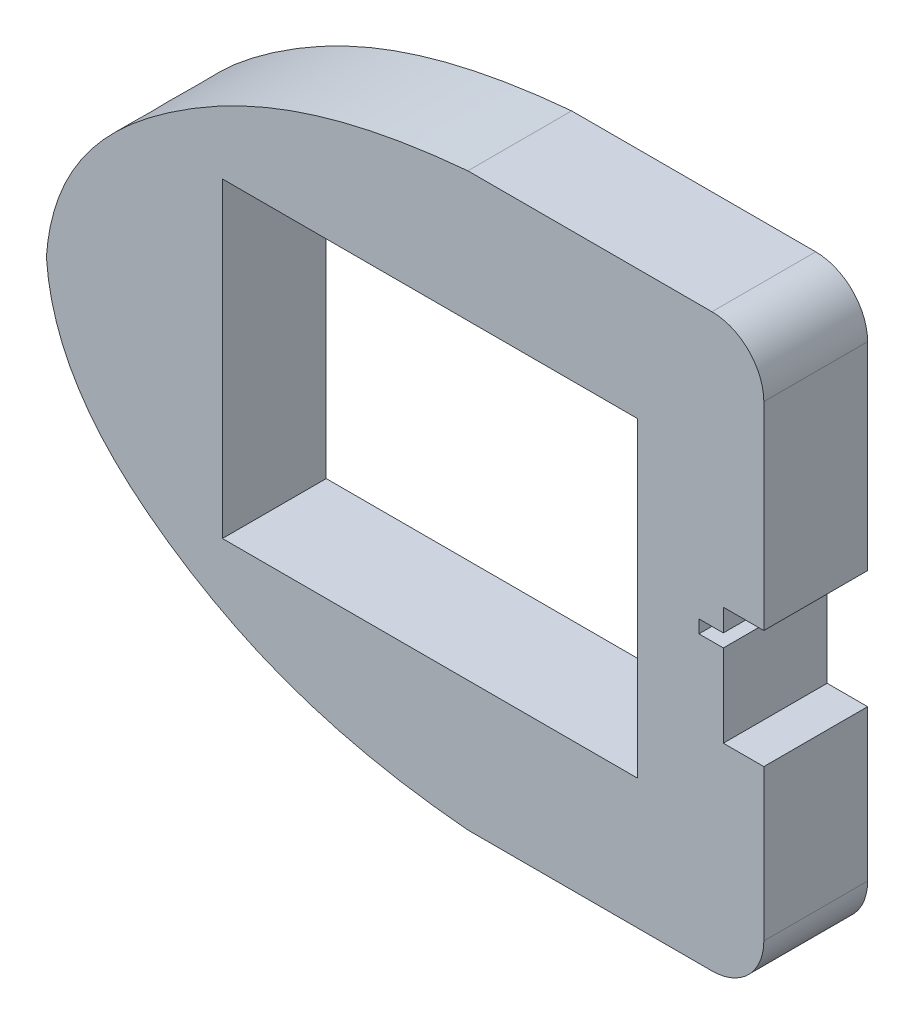
ISO-10303-21;
HEADER;
FILE_DESCRIPTION(('STEP AP214'),'2;1');
FILE_NAME('part.step','',(''),(''),'','','');
FILE_SCHEMA(('AUTOMOTIVE_DESIGN { 1 0 10303 214 1 1 1 1 }'));
ENDSEC;
DATA;
#1=APPLICATION_CONTEXT('core data for automotive mechanical design processes');
#2=APPLICATION_PROTOCOL_DEFINITION('international standard','automotive_design',2000,#1);
#3=PRODUCT_CONTEXT('',#1,'mechanical');
#4=PRODUCT('Part','Part','',(#3));
#5=PRODUCT_RELATED_PRODUCT_CATEGORY('part','',(#4));
#6=PRODUCT_DEFINITION_FORMATION('','',#4);
#7=PRODUCT_DEFINITION_CONTEXT('part definition',#1,'design');
#8=PRODUCT_DEFINITION('design','',#6,#7);
#9=PRODUCT_DEFINITION_SHAPE('','',#8);
#10=(LENGTH_UNIT() NAMED_UNIT(*) SI_UNIT(.MILLI.,.METRE.));
#11=(NAMED_UNIT(*) PLANE_ANGLE_UNIT() SI_UNIT($,.RADIAN.));
#12=(NAMED_UNIT(*) SI_UNIT($,.STERADIAN.) SOLID_ANGLE_UNIT());
#13=UNCERTAINTY_MEASURE_WITH_UNIT(LENGTH_MEASURE(1.E-05),#10,'distance_accuracy_value','');
#14=(GEOMETRIC_REPRESENTATION_CONTEXT(3) GLOBAL_UNCERTAINTY_ASSIGNED_CONTEXT((#13)) GLOBAL_UNIT_ASSIGNED_CONTEXT((#10,
#11,#12)) REPRESENTATION_CONTEXT('',''));
#15=CARTESIAN_POINT('',(0.,0.,0.));
#16=DIRECTION('',(0.,0.,1.));
#17=DIRECTION('',(1.,0.,0.));
#18=AXIS2_PLACEMENT_3D('',#15,#16,#17);
#19=CARTESIAN_POINT('',(57.0271502709847,44.9999999999999,20.));
#20=DIRECTION('',(-1.,0.,0.));
#21=DIRECTION('',(0.,0.,1.));
#22=AXIS2_PLACEMENT_3D('',#19,#20,#21);
#23=PLANE('',#22);
#24=DIRECTION('',(0.,1.,0.));
#25=VECTOR('',#24,1.);
#26=CARTESIAN_POINT('',(57.0271502709847,44.9999999999999,20.));
#27=LINE('',#26,#25);
#28=CARTESIAN_POINT('',(57.0271502709847,6.8,20.));
#29=VERTEX_POINT('',#28);
#30=CARTESIAN_POINT('',(57.0271502709847,44.9999999999999,20.));
#31=VERTEX_POINT('',#30);
#32=EDGE_CURVE('E287',#29,#31,#27,.T.);
#33=ORIENTED_EDGE('',*,*,#32,.F.);
#34=DIRECTION('',(0.,0.,1.));
#35=VECTOR('',#34,1.);
#36=CARTESIAN_POINT('',(57.0271502709847,6.8,0.));
#37=LINE('',#36,#35);
#38=CARTESIAN_POINT('',(57.0271502709847,6.8,0.));
#39=VERTEX_POINT('',#38);
#40=EDGE_CURVE('E238',#39,#29,#37,.T.);
#41=ORIENTED_EDGE('',*,*,#40,.F.);
#42=DIRECTION('',(0.,1.,0.));
#43=VECTOR('',#42,1.);
#44=CARTESIAN_POINT('',(57.0271502709847,44.9999999999999,0.));
#45=LINE('',#44,#43);
#46=CARTESIAN_POINT('',(57.0271502709847,44.9999999999999,0.));
#47=VERTEX_POINT('',#46);
#48=EDGE_CURVE('E361',#39,#47,#45,.T.);
#49=ORIENTED_EDGE('',*,*,#48,.T.);
#50=DIRECTION('',(0.,0.,-1.));
#51=VECTOR('',#50,1.);
#52=CARTESIAN_POINT('',(57.0271502709847,44.9999999999999,20.));
#53=LINE('',#52,#51);
#54=EDGE_CURVE('E350',#31,#47,#53,.T.);
#55=ORIENTED_EDGE('',*,*,#54,.F.);
#56=EDGE_LOOP('',(#33,#41,#49,#55));
#57=FACE_BOUND('',#56,.T.);
#58=ADVANCED_FACE('F33',(#57),#23,.F.);
#59=CARTESIAN_POINT('',(-81.2118249208851,0.,20.));
#60=CARTESIAN_POINT('',(-80.0304876264252,-16.8295020981002,20.));
#61=CARTESIAN_POINT('',(-64.3384253383699,-33.1470306219505,20.));
#62=CARTESIAN_POINT('',(-38.6517677483325,-47.0670050079767,20.));
#63=CARTESIAN_POINT('',(-19.2355859634309,-52.6555511017442,20.));
#64=CARTESIAN_POINT('',(-6.27552127308021,-54.4372009233797,20.));
#65=CARTESIAN_POINT('',(-0.452392387786748,-54.9599479244757,20.));
#66=B_SPLINE_CURVE_WITH_KNOTS('',3,(#59,#60,#61,#62,#63,#64,#65),.UNSPECIFIED.,.F.,.F.,(4,1,1,1,
4),(0.,0.422832960593759,0.624311743177886,0.828189208749844,0.995662593702398),.UNSPECIFIED.);
#67=DIRECTION('',(0.,0.,-1.));
#68=VECTOR('',#67,1.);
#69=SURFACE_OF_LINEAR_EXTRUSION('',#66,#68);
#70=CARTESIAN_POINT('',(-81.2118249208851,0.,0.));
#71=CARTESIAN_POINT('',(-80.0304876264252,-16.8295020981002,0.));
#72=CARTESIAN_POINT('',(-64.3384253383699,-33.1470306219505,0.));
#73=CARTESIAN_POINT('',(-38.6517677483325,-47.0670050079767,0.));
#74=CARTESIAN_POINT('',(-19.2355859634309,-52.6555511017442,0.));
#75=CARTESIAN_POINT('',(-6.27552127308021,-54.4372009233797,0.));
#76=CARTESIAN_POINT('',(-0.452392387786748,-54.9599479244757,0.));
#77=B_SPLINE_CURVE_WITH_KNOTS('',3,(#70,#71,#72,#73,#74,#75,#76),.UNSPECIFIED.,.F.,.F.,(4,1,1,1,
4),(0.,0.422832960593759,0.624311743177886,0.828189208749844,0.995662593702398),.UNSPECIFIED.);
#78=CARTESIAN_POINT('',(-81.2118249208851,0.,0.));
#79=VERTEX_POINT('',#78);
#80=CARTESIAN_POINT('',(-0.452392387786744,-54.9599479244757,0.));
#81=VERTEX_POINT('',#80);
#82=EDGE_CURVE('E266',#79,#81,#77,.T.);
#83=ORIENTED_EDGE('',*,*,#82,.T.);
#84=DIRECTION('',(0.,0.,-1.));
#85=VECTOR('',#84,1.);
#86=CARTESIAN_POINT('',(-0.452392387786744,-54.9599479244757,20.));
#87=LINE('',#86,#85);
#88=CARTESIAN_POINT('',(-0.452392387786744,-54.9599479244757,20.));
#89=VERTEX_POINT('',#88);
#90=EDGE_CURVE('E11',#89,#81,#87,.T.);
#91=ORIENTED_EDGE('',*,*,#90,.F.);
#92=CARTESIAN_POINT('',(-81.2118249208851,0.,20.));
#93=VERTEX_POINT('',#92);
#94=EDGE_CURVE('E271',#93,#89,#66,.T.);
#95=ORIENTED_EDGE('',*,*,#94,.F.);
#96=DIRECTION('',(0.,0.,-1.));
#97=VECTOR('',#96,1.);
#98=CARTESIAN_POINT('',(-81.2118249208851,0.,20.));
#99=LINE('',#98,#97);
#100=EDGE_CURVE('E300',#93,#79,#99,.T.);
#101=ORIENTED_EDGE('',*,*,#100,.T.);
#102=EDGE_LOOP('',(#83,#91,#95,#101));
#103=FACE_BOUND('',#102,.T.);
#104=ADVANCED_FACE('F35',(#103),#69,.F.);
#105=CARTESIAN_POINT('',(0.441720212355299,-45.,20.));
#106=DIRECTION('',(0.,0.,-1.));
#107=DIRECTION('',(-1.,0.,0.));
#108=AXIS2_PLACEMENT_3D('',#105,#106,#107);
#109=CYLINDRICAL_SURFACE('',#108,10.);
#110=CARTESIAN_POINT('',(0.441720212355299,-45.,0.));
#111=DIRECTION('',(0.,0.,1.));
#112=DIRECTION('',(-1.,0.,0.));
#113=AXIS2_PLACEMENT_3D('',#110,#111,#112);
#114=CIRCLE('',#113,10.);
#115=CARTESIAN_POINT('',(0.441720212355214,-55.,0.));
#116=VERTEX_POINT('',#115);
#117=EDGE_CURVE('E401',#81,#116,#114,.T.);
#118=ORIENTED_EDGE('',*,*,#117,.T.);
#119=DIRECTION('',(0.,0.,-1.));
#120=VECTOR('',#119,1.);
#121=CARTESIAN_POINT('',(0.441720212355214,-55.,20.));
#122=LINE('',#121,#120);
#123=CARTESIAN_POINT('',(0.441720212355214,-55.,20.));
#124=VERTEX_POINT('',#123);
#125=EDGE_CURVE('E42',#124,#116,#122,.T.);
#126=ORIENTED_EDGE('',*,*,#125,.F.);
#127=CARTESIAN_POINT('',(0.441720212355299,-45.,20.));
#128=DIRECTION('',(0.,0.,1.));
#129=DIRECTION('',(-1.,0.,0.));
#130=AXIS2_PLACEMENT_3D('',#127,#128,#129);
#131=CIRCLE('',#130,10.);
#132=EDGE_CURVE('E277',#89,#124,#131,.T.);
#133=ORIENTED_EDGE('',*,*,#132,.F.);
#134=ORIENTED_EDGE('',*,*,#90,.T.);
#135=EDGE_LOOP('',(#118,#126,#133,#134));
#136=FACE_BOUND('',#135,.T.);
#137=ADVANCED_FACE('F333',(#136),#109,.T.);
#138=CARTESIAN_POINT('',(0.441720212355214,-55.,20.));
#139=DIRECTION('',(0.,1.,0.));
#140=DIRECTION('',(0.,0.,1.));
#141=AXIS2_PLACEMENT_3D('',#138,#139,#140);
#142=PLANE('',#141);
#143=DIRECTION('',(1.,0.,0.));
#144=VECTOR('',#143,1.);
#145=CARTESIAN_POINT('',(0.441720212355214,-55.,0.));
#146=LINE('',#145,#144);
#147=CARTESIAN_POINT('',(47.0271502709846,-55.,0.));
#148=VERTEX_POINT('',#147);
#149=EDGE_CURVE('E367',#116,#148,#146,.T.);
#150=ORIENTED_EDGE('',*,*,#149,.T.);
#151=DIRECTION('',(0.,0.,-1.));
#152=VECTOR('',#151,1.);
#153=CARTESIAN_POINT('',(47.0271502709846,-55.,20.));
#154=LINE('',#153,#152);
#155=CARTESIAN_POINT('',(47.0271502709846,-55.,20.));
#156=VERTEX_POINT('',#155);
#157=EDGE_CURVE('E392',#156,#148,#154,.T.);
#158=ORIENTED_EDGE('',*,*,#157,.F.);
#159=DIRECTION('',(1.,0.,0.));
#160=VECTOR('',#159,1.);
#161=CARTESIAN_POINT('',(0.441720212355214,-55.,20.));
#162=LINE('',#161,#160);
#163=EDGE_CURVE('E283',#124,#156,#162,.T.);
#164=ORIENTED_EDGE('',*,*,#163,.F.);
#165=ORIENTED_EDGE('',*,*,#125,.T.);
#166=EDGE_LOOP('',(#150,#158,#164,#165));
#167=FACE_BOUND('',#166,.T.);
#168=ADVANCED_FACE('F330',(#167),#142,.F.);
#169=CARTESIAN_POINT('',(47.0271502709847,-45.,20.));
#170=DIRECTION('',(0.,0.,-1.));
#171=DIRECTION('',(-1.,0.,0.));
#172=AXIS2_PLACEMENT_3D('',#169,#170,#171);
#173=CYLINDRICAL_SURFACE('',#172,10.);
#174=CARTESIAN_POINT('',(47.0271502709847,-45.,0.));
#175=DIRECTION('',(0.,0.,1.));
#176=DIRECTION('',(-1.,0.,0.));
#177=AXIS2_PLACEMENT_3D('',#174,#175,#176);
#178=CIRCLE('',#177,10.);
#179=CARTESIAN_POINT('',(57.0271502709847,-44.9999999999999,0.));
#180=VERTEX_POINT('',#179);
#181=EDGE_CURVE('E365',#148,#180,#178,.T.);
#182=ORIENTED_EDGE('',*,*,#181,.T.);
#183=DIRECTION('',(0.,0.,-1.));
#184=VECTOR('',#183,1.);
#185=CARTESIAN_POINT('',(57.0271502709847,-44.9999999999999,20.));
#186=LINE('',#185,#184);
#187=CARTESIAN_POINT('',(57.0271502709847,-44.9999999999999,20.));
#188=VERTEX_POINT('',#187);
#189=EDGE_CURVE('E389',#188,#180,#186,.T.);
#190=ORIENTED_EDGE('',*,*,#189,.F.);
#191=CARTESIAN_POINT('',(47.0271502709847,-45.,20.));
#192=DIRECTION('',(0.,0.,1.));
#193=DIRECTION('',(-1.,0.,0.));
#194=AXIS2_PLACEMENT_3D('',#191,#192,#193);
#195=CIRCLE('',#194,10.);
#196=EDGE_CURVE('E285',#156,#188,#195,.T.);
#197=ORIENTED_EDGE('',*,*,#196,.F.);
#198=ORIENTED_EDGE('',*,*,#157,.T.);
#199=EDGE_LOOP('',(#182,#190,#197,#198));
#200=FACE_BOUND('',#199,.T.);
#201=ADVANCED_FACE('F326',(#200),#173,.T.);
#202=CARTESIAN_POINT('',(57.0271502709847,-15.9,0.));
#203=VERTEX_POINT('',#202);
#204=EDGE_CURVE('E364',#180,#203,#45,.T.);
#205=ORIENTED_EDGE('',*,*,#204,.T.);
#206=DIRECTION('',(0.,0.,1.));
#207=VECTOR('',#206,1.);
#208=CARTESIAN_POINT('',(57.0271502709847,-15.9,0.));
#209=LINE('',#208,#207);
#210=CARTESIAN_POINT('',(57.0271502709847,-15.9,20.));
#211=VERTEX_POINT('',#210);
#212=EDGE_CURVE('E49',#203,#211,#209,.T.);
#213=ORIENTED_EDGE('',*,*,#212,.T.);
#214=EDGE_CURVE('E288',#188,#211,#27,.T.);
#215=ORIENTED_EDGE('',*,*,#214,.F.);
#216=ORIENTED_EDGE('',*,*,#189,.T.);
#217=EDGE_LOOP('',(#205,#213,#215,#216));
#218=FACE_BOUND('',#217,.T.);
#219=ADVANCED_FACE('F322',(#218),#23,.F.);
#220=CARTESIAN_POINT('',(47.0271502709847,45.,20.));
#221=DIRECTION('',(0.,0.,-1.));
#222=DIRECTION('',(-1.,0.,0.));
#223=AXIS2_PLACEMENT_3D('',#220,#221,#222);
#224=CYLINDRICAL_SURFACE('',#223,10.);
#225=CARTESIAN_POINT('',(47.0271502709847,45.,0.));
#226=DIRECTION('',(0.,0.,1.));
#227=DIRECTION('',(1.,0.,0.));
#228=AXIS2_PLACEMENT_3D('',#225,#226,#227);
#229=CIRCLE('',#228,10.);
#230=CARTESIAN_POINT('',(47.0271502709846,55.,0.));
#231=VERTEX_POINT('',#230);
#232=EDGE_CURVE('E363',#47,#231,#229,.T.);
#233=ORIENTED_EDGE('',*,*,#232,.T.);
#234=DIRECTION('',(0.,0.,-1.));
#235=VECTOR('',#234,1.);
#236=CARTESIAN_POINT('',(47.0271502709846,55.,20.));
#237=LINE('',#236,#235);
#238=CARTESIAN_POINT('',(47.0271502709846,55.,20.));
#239=VERTEX_POINT('',#238);
#240=EDGE_CURVE('E385',#239,#231,#237,.T.);
#241=ORIENTED_EDGE('',*,*,#240,.F.);
#242=CARTESIAN_POINT('',(47.0271502709847,45.,20.));
#243=DIRECTION('',(0.,0.,1.));
#244=DIRECTION('',(1.,0.,0.));
#245=AXIS2_PLACEMENT_3D('',#242,#243,#244);
#246=CIRCLE('',#245,10.);
#247=EDGE_CURVE('E291',#31,#239,#246,.T.);
#248=ORIENTED_EDGE('',*,*,#247,.F.);
#249=ORIENTED_EDGE('',*,*,#54,.T.);
#250=EDGE_LOOP('',(#233,#241,#248,#249));
#251=FACE_BOUND('',#250,.T.);
#252=ADVANCED_FACE('F318',(#251),#224,.T.);
#253=CARTESIAN_POINT('',(0.,55.,20.));
#254=DIRECTION('',(0.,-1.,0.));
#255=DIRECTION('',(0.,0.,-1.));
#256=AXIS2_PLACEMENT_3D('',#253,#254,#255);
#257=PLANE('',#256);
#258=DIRECTION('',(-1.,0.,0.));
#259=VECTOR('',#258,1.);
#260=CARTESIAN_POINT('',(0.,55.,0.));
#261=LINE('',#260,#259);
#262=CARTESIAN_POINT('',(0.,55.,0.));
#263=VERTEX_POINT('',#262);
#264=EDGE_CURVE('E372',#231,#263,#261,.T.);
#265=ORIENTED_EDGE('',*,*,#264,.T.);
#266=DIRECTION('',(0.,0.,-1.));
#267=VECTOR('',#266,1.);
#268=CARTESIAN_POINT('',(0.,55.,20.));
#269=LINE('',#268,#267);
#270=CARTESIAN_POINT('',(0.,55.,20.));
#271=VERTEX_POINT('',#270);
#272=EDGE_CURVE('E382',#271,#263,#269,.T.);
#273=ORIENTED_EDGE('',*,*,#272,.F.);
#274=DIRECTION('',(-1.,0.,0.));
#275=VECTOR('',#274,1.);
#276=CARTESIAN_POINT('',(0.,55.,20.));
#277=LINE('',#276,#275);
#278=EDGE_CURVE('E293',#239,#271,#277,.T.);
#279=ORIENTED_EDGE('',*,*,#278,.F.);
#280=ORIENTED_EDGE('',*,*,#240,.T.);
#281=EDGE_LOOP('',(#265,#273,#279,#280));
#282=FACE_BOUND('',#281,.T.);
#283=ADVANCED_FACE('F313',(#282),#257,.F.);
#284=CARTESIAN_POINT('',(0.,55.,20.));
#285=CARTESIAN_POINT('',(-13.0594387619236,53.85990184488,20.));
#286=CARTESIAN_POINT('',(-33.3232137576277,49.9543882404975,20.));
#287=CARTESIAN_POINT('',(-64.338739167256,33.1469918638518,20.));
#288=CARTESIAN_POINT('',(-80.0302145197742,16.8295358269729,20.));
#289=CARTESIAN_POINT('',(-81.2118249208851,0.,20.));
#290=B_SPLINE_CURVE_WITH_KNOTS('',3,(#284,#285,#286,#287,#288,#289),.UNSPECIFIED.,.F.,.F.,(4,1,
1,4),(0.,0.375672095501509,0.577156093690237,1.),.UNSPECIFIED.);
#291=DIRECTION('',(0.,0.,-1.));
#292=VECTOR('',#291,1.);
#293=SURFACE_OF_LINEAR_EXTRUSION('',#290,#292);
#294=CARTESIAN_POINT('',(0.,55.,0.));
#295=CARTESIAN_POINT('',(-13.0594387619236,53.85990184488,0.));
#296=CARTESIAN_POINT('',(-33.3232137576277,49.9543882404975,0.));
#297=CARTESIAN_POINT('',(-64.338739167256,33.1469918638518,0.));
#298=CARTESIAN_POINT('',(-80.0302145197742,16.8295358269729,0.));
#299=CARTESIAN_POINT('',(-81.2118249208851,0.,0.));
#300=B_SPLINE_CURVE_WITH_KNOTS('',3,(#294,#295,#296,#297,#298,#299),.UNSPECIFIED.,.F.,.F.,(4,1,
1,4),(0.,0.375672095501509,0.577156093690237,1.),.UNSPECIFIED.);
#301=EDGE_CURVE('E278',#263,#79,#300,.T.);
#302=ORIENTED_EDGE('',*,*,#301,.T.);
#303=ORIENTED_EDGE('',*,*,#100,.F.);
#304=EDGE_CURVE('E295',#271,#93,#290,.T.);
#305=ORIENTED_EDGE('',*,*,#304,.F.);
#306=ORIENTED_EDGE('',*,*,#272,.T.);
#307=EDGE_LOOP('',(#302,#303,#305,#306));
#308=FACE_BOUND('',#307,.T.);
#309=ADVANCED_FACE('F308',(#308),#293,.F.);
#310=CARTESIAN_POINT('',(-50.3852403690422,-40.462655403915,20.));
#311=DIRECTION('',(0.,0.,-1.));
#312=DIRECTION('',(-1.,0.,0.));
#313=AXIS2_PLACEMENT_3D('',#310,#311,#312);
#314=PLANE('',#313);
#315=DIRECTION('',(0.,-1.,0.));
#316=VECTOR('',#315,1.);
#317=CARTESIAN_POINT('',(-47.2893596960204,-30.,20.));
#318=LINE('',#317,#316);
#319=CARTESIAN_POINT('',(-47.2893596960204,30.,20.));
#320=VERTEX_POINT('',#319);
#321=CARTESIAN_POINT('',(-47.2893596960204,-30.,20.));
#322=VERTEX_POINT('',#321);
#323=EDGE_CURVE('E256',#320,#322,#318,.T.);
#324=ORIENTED_EDGE('',*,*,#323,.F.);
#325=DIRECTION('',(-1.,0.,0.));
#326=VECTOR('',#325,1.);
#327=CARTESIAN_POINT('',(-47.2893596960204,30.,20.));
#328=LINE('',#327,#326);
#329=CARTESIAN_POINT('',(32.7106403039796,30.,20.));
#330=VERTEX_POINT('',#329);
#331=EDGE_CURVE('E57',#330,#320,#328,.T.);
#332=ORIENTED_EDGE('',*,*,#331,.F.);
#333=DIRECTION('',(0.,1.,0.));
#334=VECTOR('',#333,1.);
#335=CARTESIAN_POINT('',(32.7106403039796,30.,20.));
#336=LINE('',#335,#334);
#337=CARTESIAN_POINT('',(32.7106403039796,-30.,20.));
#338=VERTEX_POINT('',#337);
#339=EDGE_CURVE('E245',#338,#330,#336,.T.);
#340=ORIENTED_EDGE('',*,*,#339,.F.);
#341=DIRECTION('',(1.,0.,0.));
#342=VECTOR('',#341,1.);
#343=CARTESIAN_POINT('',(32.7106403039796,-30.,20.));
#344=LINE('',#343,#342);
#345=EDGE_CURVE('E259',#322,#338,#344,.T.);
#346=ORIENTED_EDGE('',*,*,#345,.F.);
#347=EDGE_LOOP('',(#324,#332,#340,#346));
#348=FACE_BOUND('',#347,.T.);
#349=DIRECTION('',(0.,-1.,0.));
#350=VECTOR('',#349,1.);
#351=CARTESIAN_POINT('',(49.2271502709847,6.8,20.));
#352=LINE('',#351,#350);
#353=CARTESIAN_POINT('',(49.2271502709847,6.8,20.));
#354=VERTEX_POINT('',#353);
#355=CARTESIAN_POINT('',(49.2271502709847,2.5,20.));
#356=VERTEX_POINT('',#355);
#357=EDGE_CURVE('E220',#354,#356,#352,.T.);
#358=ORIENTED_EDGE('',*,*,#357,.F.);
#359=DIRECTION('',(-1.,0.,0.));
#360=VECTOR('',#359,1.);
#361=CARTESIAN_POINT('',(57.0271502709847,6.8,20.));
#362=LINE('',#361,#360);
#363=EDGE_CURVE('E217',#29,#354,#362,.T.);
#364=ORIENTED_EDGE('',*,*,#363,.F.);
#365=ORIENTED_EDGE('',*,*,#32,.T.);
#366=ORIENTED_EDGE('',*,*,#247,.T.);
#367=ORIENTED_EDGE('',*,*,#278,.T.);
#368=ORIENTED_EDGE('',*,*,#304,.T.);
#369=ORIENTED_EDGE('',*,*,#94,.T.);
#370=ORIENTED_EDGE('',*,*,#132,.T.);
#371=ORIENTED_EDGE('',*,*,#163,.T.);
#372=ORIENTED_EDGE('',*,*,#196,.T.);
#373=ORIENTED_EDGE('',*,*,#214,.T.);
#374=DIRECTION('',(1.,0.,0.));
#375=VECTOR('',#374,1.);
#376=CARTESIAN_POINT('',(49.2271502709847,-15.9,20.));
#377=LINE('',#376,#375);
#378=CARTESIAN_POINT('',(49.2271502709847,-15.9,20.));
#379=VERTEX_POINT('',#378);
#380=EDGE_CURVE('E214',#379,#211,#377,.T.);
#381=ORIENTED_EDGE('',*,*,#380,.F.);
#382=DIRECTION('',(0.,-1.,0.));
#383=VECTOR('',#382,1.);
#384=CARTESIAN_POINT('',(49.2271502709847,0.,20.));
#385=LINE('',#384,#383);
#386=CARTESIAN_POINT('',(49.2271502709847,0.,20.));
#387=VERTEX_POINT('',#386);
#388=EDGE_CURVE('E178',#387,#379,#385,.T.);
#389=ORIENTED_EDGE('',*,*,#388,.F.);
#390=DIRECTION('',(1.,0.,0.));
#391=VECTOR('',#390,1.);
#392=CARTESIAN_POINT('',(49.2271502709847,0.,20.));
#393=LINE('',#392,#391);
#394=CARTESIAN_POINT('',(44.5271502709847,0.,20.));
#395=VERTEX_POINT('',#394);
#396=EDGE_CURVE('E194',#395,#387,#393,.T.);
#397=ORIENTED_EDGE('',*,*,#396,.F.);
#398=DIRECTION('',(0.,-1.,0.));
#399=VECTOR('',#398,1.);
#400=CARTESIAN_POINT('',(44.5271502709847,0.,20.));
#401=LINE('',#400,#399);
#402=CARTESIAN_POINT('',(44.5271502709847,2.5,20.));
#403=VERTEX_POINT('',#402);
#404=EDGE_CURVE('E197',#403,#395,#401,.T.);
#405=ORIENTED_EDGE('',*,*,#404,.F.);
#406=DIRECTION('',(-1.,0.,0.));
#407=VECTOR('',#406,1.);
#408=CARTESIAN_POINT('',(44.5271502709847,2.5,20.));
#409=LINE('',#408,#407);
#410=EDGE_CURVE('E223',#356,#403,#409,.T.);
#411=ORIENTED_EDGE('',*,*,#410,.F.);
#412=EDGE_LOOP('',(#358,#364,#365,#366,#367,#368,#369,#370,#371,#372,#373,#381,#389,#397,#405,#411));
#413=FACE_BOUND('',#412,.T.);
#414=ADVANCED_FACE('F312',(#348,#413),#314,.F.);
#415=CARTESIAN_POINT('',(-50.3852403690422,-40.462655403915,0.));
#416=DIRECTION('',(0.,0.,-1.));
#417=DIRECTION('',(-1.,0.,0.));
#418=AXIS2_PLACEMENT_3D('',#415,#416,#417);
#419=PLANE('',#418);
#420=DIRECTION('',(-1.,0.,0.));
#421=VECTOR('',#420,1.);
#422=CARTESIAN_POINT('',(57.0271502709847,6.8,0.));
#423=LINE('',#422,#421);
#424=CARTESIAN_POINT('',(49.2271502709847,6.8,0.));
#425=VERTEX_POINT('',#424);
#426=EDGE_CURVE('E187',#39,#425,#423,.T.);
#427=ORIENTED_EDGE('',*,*,#426,.T.);
#428=DIRECTION('',(0.,-1.,0.));
#429=VECTOR('',#428,1.);
#430=CARTESIAN_POINT('',(49.2271502709847,6.8,0.));
#431=LINE('',#430,#429);
#432=CARTESIAN_POINT('',(49.2271502709847,2.5,0.));
#433=VERTEX_POINT('',#432);
#434=EDGE_CURVE('E204',#425,#433,#431,.T.);
#435=ORIENTED_EDGE('',*,*,#434,.T.);
#436=DIRECTION('',(-1.,0.,0.));
#437=VECTOR('',#436,1.);
#438=CARTESIAN_POINT('',(44.5271502709847,2.5,0.));
#439=LINE('',#438,#437);
#440=CARTESIAN_POINT('',(44.5271502709847,2.5,0.));
#441=VERTEX_POINT('',#440);
#442=EDGE_CURVE('E207',#433,#441,#439,.T.);
#443=ORIENTED_EDGE('',*,*,#442,.T.);
#444=DIRECTION('',(0.,-1.,0.));
#445=VECTOR('',#444,1.);
#446=CARTESIAN_POINT('',(44.5271502709847,0.,0.));
#447=LINE('',#446,#445);
#448=CARTESIAN_POINT('',(44.5271502709847,0.,0.));
#449=VERTEX_POINT('',#448);
#450=EDGE_CURVE('E210',#441,#449,#447,.T.);
#451=ORIENTED_EDGE('',*,*,#450,.T.);
#452=DIRECTION('',(1.,0.,0.));
#453=VECTOR('',#452,1.);
#454=CARTESIAN_POINT('',(49.2271502709847,0.,0.));
#455=LINE('',#454,#453);
#456=CARTESIAN_POINT('',(49.2271502709847,0.,0.));
#457=VERTEX_POINT('',#456);
#458=EDGE_CURVE('E180',#449,#457,#455,.T.);
#459=ORIENTED_EDGE('',*,*,#458,.T.);
#460=DIRECTION('',(0.,-1.,0.));
#461=VECTOR('',#460,1.);
#462=CARTESIAN_POINT('',(49.2271502709847,0.,0.));
#463=LINE('',#462,#461);
#464=CARTESIAN_POINT('',(49.2271502709847,-15.9,0.));
#465=VERTEX_POINT('',#464);
#466=EDGE_CURVE('E175',#457,#465,#463,.T.);
#467=ORIENTED_EDGE('',*,*,#466,.T.);
#468=DIRECTION('',(1.,0.,0.));
#469=VECTOR('',#468,1.);
#470=CARTESIAN_POINT('',(49.2271502709847,-15.9,0.));
#471=LINE('',#470,#469);
#472=EDGE_CURVE('E182',#465,#203,#471,.T.);
#473=ORIENTED_EDGE('',*,*,#472,.T.);
#474=ORIENTED_EDGE('',*,*,#204,.F.);
#475=ORIENTED_EDGE('',*,*,#181,.F.);
#476=ORIENTED_EDGE('',*,*,#149,.F.);
#477=ORIENTED_EDGE('',*,*,#117,.F.);
#478=ORIENTED_EDGE('',*,*,#82,.F.);
#479=ORIENTED_EDGE('',*,*,#301,.F.);
#480=ORIENTED_EDGE('',*,*,#264,.F.);
#481=ORIENTED_EDGE('',*,*,#232,.F.);
#482=ORIENTED_EDGE('',*,*,#48,.F.);
#483=EDGE_LOOP('',(#427,#435,#443,#451,#459,#467,#473,#474,#475,#476,#477,#478,#479,#480,#481,#482));
#484=FACE_BOUND('',#483,.T.);
#485=DIRECTION('',(-1.,0.,0.));
#486=VECTOR('',#485,1.);
#487=CARTESIAN_POINT('',(-47.2893596960204,30.,0.));
#488=LINE('',#487,#486);
#489=CARTESIAN_POINT('',(32.7106403039796,30.,0.));
#490=VERTEX_POINT('',#489);
#491=CARTESIAN_POINT('',(-47.2893596960204,30.,0.));
#492=VERTEX_POINT('',#491);
#493=EDGE_CURVE('E241',#490,#492,#488,.T.);
#494=ORIENTED_EDGE('',*,*,#493,.T.);
#495=DIRECTION('',(0.,-1.,0.));
#496=VECTOR('',#495,1.);
#497=CARTESIAN_POINT('',(-47.2893596960204,-30.,0.));
#498=LINE('',#497,#496);
#499=CARTESIAN_POINT('',(-47.2893596960204,-30.,0.));
#500=VERTEX_POINT('',#499);
#501=EDGE_CURVE('E244',#492,#500,#498,.T.);
#502=ORIENTED_EDGE('',*,*,#501,.T.);
#503=DIRECTION('',(1.,0.,0.));
#504=VECTOR('',#503,1.);
#505=CARTESIAN_POINT('',(32.7106403039796,-30.,0.));
#506=LINE('',#505,#504);
#507=CARTESIAN_POINT('',(32.7106403039796,-30.,0.));
#508=VERTEX_POINT('',#507);
#509=EDGE_CURVE('E248',#500,#508,#506,.T.);
#510=ORIENTED_EDGE('',*,*,#509,.T.);
#511=DIRECTION('',(0.,1.,0.));
#512=VECTOR('',#511,1.);
#513=CARTESIAN_POINT('',(32.7106403039796,30.,0.));
#514=LINE('',#513,#512);
#515=EDGE_CURVE('E251',#508,#490,#514,.T.);
#516=ORIENTED_EDGE('',*,*,#515,.T.);
#517=EDGE_LOOP('',(#494,#502,#510,#516));
#518=FACE_BOUND('',#517,.T.);
#519=ADVANCED_FACE('F190',(#484,#518),#419,.T.);
#520=CARTESIAN_POINT('',(-47.2893596960204,30.,0.));
#521=DIRECTION('',(0.,1.,0.));
#522=DIRECTION('',(-1.,0.,0.));
#523=AXIS2_PLACEMENT_3D('',#520,#521,#522);
#524=PLANE('',#523);
#525=ORIENTED_EDGE('',*,*,#331,.T.);
#526=DIRECTION('',(0.,0.,1.));
#527=VECTOR('',#526,1.);
#528=CARTESIAN_POINT('',(-47.2893596960204,30.,0.));
#529=LINE('',#528,#527);
#530=EDGE_CURVE('E254',#492,#320,#529,.T.);
#531=ORIENTED_EDGE('',*,*,#530,.F.);
#532=ORIENTED_EDGE('',*,*,#493,.F.);
#533=DIRECTION('',(0.,0.,1.));
#534=VECTOR('',#533,1.);
#535=CARTESIAN_POINT('',(32.7106403039796,30.,0.));
#536=LINE('',#535,#534);
#537=EDGE_CURVE('E264',#490,#330,#536,.T.);
#538=ORIENTED_EDGE('',*,*,#537,.T.);
#539=EDGE_LOOP('',(#525,#531,#532,#538));
#540=FACE_BOUND('',#539,.T.);
#541=ADVANCED_FACE('F446',(#540),#524,.F.);
#542=CARTESIAN_POINT('',(32.7106403039796,30.,0.));
#543=DIRECTION('',(1.,0.,0.));
#544=DIRECTION('',(0.,0.,-1.));
#545=AXIS2_PLACEMENT_3D('',#542,#543,#544);
#546=PLANE('',#545);
#547=ORIENTED_EDGE('',*,*,#339,.T.);
#548=ORIENTED_EDGE('',*,*,#537,.F.);
#549=ORIENTED_EDGE('',*,*,#515,.F.);
#550=DIRECTION('',(0.,0.,1.));
#551=VECTOR('',#550,1.);
#552=CARTESIAN_POINT('',(32.7106403039796,-30.,0.));
#553=LINE('',#552,#551);
#554=EDGE_CURVE('E267',#508,#338,#553,.T.);
#555=ORIENTED_EDGE('',*,*,#554,.T.);
#556=EDGE_LOOP('',(#547,#548,#549,#555));
#557=FACE_BOUND('',#556,.T.);
#558=ADVANCED_FACE('F442',(#557),#546,.F.);
#559=CARTESIAN_POINT('',(32.7106403039796,-30.,0.));
#560=DIRECTION('',(0.,-1.,0.));
#561=DIRECTION('',(1.,0.,0.));
#562=AXIS2_PLACEMENT_3D('',#559,#560,#561);
#563=PLANE('',#562);
#564=ORIENTED_EDGE('',*,*,#345,.T.);
#565=ORIENTED_EDGE('',*,*,#554,.F.);
#566=ORIENTED_EDGE('',*,*,#509,.F.);
#567=DIRECTION('',(0.,0.,1.));
#568=VECTOR('',#567,1.);
#569=CARTESIAN_POINT('',(-47.2893596960204,-30.,0.));
#570=LINE('',#569,#568);
#571=EDGE_CURVE('E269',#500,#322,#570,.T.);
#572=ORIENTED_EDGE('',*,*,#571,.T.);
#573=EDGE_LOOP('',(#564,#565,#566,#572));
#574=FACE_BOUND('',#573,.T.);
#575=ADVANCED_FACE('F445',(#574),#563,.F.);
#576=CARTESIAN_POINT('',(-47.2893596960204,-30.,0.));
#577=DIRECTION('',(-1.,0.,0.));
#578=DIRECTION('',(0.,0.,1.));
#579=AXIS2_PLACEMENT_3D('',#576,#577,#578);
#580=PLANE('',#579);
#581=ORIENTED_EDGE('',*,*,#323,.T.);
#582=ORIENTED_EDGE('',*,*,#571,.F.);
#583=ORIENTED_EDGE('',*,*,#501,.F.);
#584=ORIENTED_EDGE('',*,*,#530,.T.);
#585=EDGE_LOOP('',(#581,#582,#583,#584));
#586=FACE_BOUND('',#585,.T.);
#587=ADVANCED_FACE('F441',(#586),#580,.F.);
#588=CARTESIAN_POINT('',(49.2271502709847,0.,0.));
#589=DIRECTION('',(-1.,0.,0.));
#590=DIRECTION('',(0.,0.,1.));
#591=AXIS2_PLACEMENT_3D('',#588,#589,#590);
#592=PLANE('',#591);
#593=ORIENTED_EDGE('',*,*,#388,.T.);
#594=DIRECTION('',(0.,0.,1.));
#595=VECTOR('',#594,1.);
#596=CARTESIAN_POINT('',(49.2271502709847,-15.9,0.));
#597=LINE('',#596,#595);
#598=EDGE_CURVE('E172',#465,#379,#597,.T.);
#599=ORIENTED_EDGE('',*,*,#598,.F.);
#600=ORIENTED_EDGE('',*,*,#466,.F.);
#601=DIRECTION('',(0.,0.,1.));
#602=VECTOR('',#601,1.);
#603=CARTESIAN_POINT('',(49.2271502709847,0.,0.));
#604=LINE('',#603,#602);
#605=EDGE_CURVE('E228',#457,#387,#604,.T.);
#606=ORIENTED_EDGE('',*,*,#605,.T.);
#607=EDGE_LOOP('',(#593,#599,#600,#606));
#608=FACE_BOUND('',#607,.T.);
#609=ADVANCED_FACE('F173',(#608),#592,.F.);
#610=CARTESIAN_POINT('',(49.2271502709847,0.,0.));
#611=DIRECTION('',(0.,-1.,0.));
#612=DIRECTION('',(0.,0.,-1.));
#613=AXIS2_PLACEMENT_3D('',#610,#611,#612);
#614=PLANE('',#613);
#615=ORIENTED_EDGE('',*,*,#396,.T.);
#616=ORIENTED_EDGE('',*,*,#605,.F.);
#617=ORIENTED_EDGE('',*,*,#458,.F.);
#618=DIRECTION('',(0.,0.,1.));
#619=VECTOR('',#618,1.);
#620=CARTESIAN_POINT('',(44.5271502709847,0.,0.));
#621=LINE('',#620,#619);
#622=EDGE_CURVE('E230',#449,#395,#621,.T.);
#623=ORIENTED_EDGE('',*,*,#622,.T.);
#624=EDGE_LOOP('',(#615,#616,#617,#623));
#625=FACE_BOUND('',#624,.T.);
#626=ADVANCED_FACE('F416',(#625),#614,.F.);
#627=CARTESIAN_POINT('',(44.5271502709847,0.,0.));
#628=DIRECTION('',(-1.,0.,0.));
#629=DIRECTION('',(0.,0.,1.));
#630=AXIS2_PLACEMENT_3D('',#627,#628,#629);
#631=PLANE('',#630);
#632=ORIENTED_EDGE('',*,*,#404,.T.);
#633=ORIENTED_EDGE('',*,*,#622,.F.);
#634=ORIENTED_EDGE('',*,*,#450,.F.);
#635=DIRECTION('',(0.,0.,1.));
#636=VECTOR('',#635,1.);
#637=CARTESIAN_POINT('',(44.5271502709847,2.5,0.));
#638=LINE('',#637,#636);
#639=EDGE_CURVE('E232',#441,#403,#638,.T.);
#640=ORIENTED_EDGE('',*,*,#639,.T.);
#641=EDGE_LOOP('',(#632,#633,#634,#640));
#642=FACE_BOUND('',#641,.T.);
#643=ADVANCED_FACE('F419',(#642),#631,.F.);
#644=CARTESIAN_POINT('',(44.5271502709847,2.5,0.));
#645=DIRECTION('',(0.,1.,0.));
#646=DIRECTION('',(0.,0.,1.));
#647=AXIS2_PLACEMENT_3D('',#644,#645,#646);
#648=PLANE('',#647);
#649=CARTESIAN_POINT('',(46.9271502709847,2.5,10.));
#650=DIRECTION('',(0.,-1.,0.));
#651=DIRECTION('',(0.,0.,-1.));
#652=AXIS2_PLACEMENT_3D('',#649,#650,#651);
#653=CIRCLE('',#652,0.999999999999998);
#654=CARTESIAN_POINT('',(46.9271502709847,2.5,9.));
#655=VERTEX_POINT('',#654);
#656=EDGE_CURVE('E200',#655,#655,#653,.T.);
#657=ORIENTED_EDGE('',*,*,#656,.F.);
#658=EDGE_LOOP('',(#657));
#659=FACE_BOUND('',#658,.T.);
#660=ORIENTED_EDGE('',*,*,#410,.T.);
#661=ORIENTED_EDGE('',*,*,#639,.F.);
#662=ORIENTED_EDGE('',*,*,#442,.F.);
#663=DIRECTION('',(0.,0.,1.));
#664=VECTOR('',#663,1.);
#665=CARTESIAN_POINT('',(49.2271502709847,2.5,0.));
#666=LINE('',#665,#664);
#667=EDGE_CURVE('E234',#433,#356,#666,.T.);
#668=ORIENTED_EDGE('',*,*,#667,.T.);
#669=EDGE_LOOP('',(#660,#661,#662,#668));
#670=FACE_BOUND('',#669,.T.);
#671=ADVANCED_FACE('F422',(#659,#670),#648,.F.);
#672=CARTESIAN_POINT('',(49.2271502709847,6.8,0.));
#673=DIRECTION('',(-1.,0.,0.));
#674=DIRECTION('',(0.,0.,1.));
#675=AXIS2_PLACEMENT_3D('',#672,#673,#674);
#676=PLANE('',#675);
#677=ORIENTED_EDGE('',*,*,#357,.T.);
#678=ORIENTED_EDGE('',*,*,#667,.F.);
#679=ORIENTED_EDGE('',*,*,#434,.F.);
#680=DIRECTION('',(0.,0.,1.));
#681=VECTOR('',#680,1.);
#682=CARTESIAN_POINT('',(49.2271502709847,6.8,0.));
#683=LINE('',#682,#681);
#684=EDGE_CURVE('E236',#425,#354,#683,.T.);
#685=ORIENTED_EDGE('',*,*,#684,.T.);
#686=EDGE_LOOP('',(#677,#678,#679,#685));
#687=FACE_BOUND('',#686,.T.);
#688=ADVANCED_FACE('F424',(#687),#676,.F.);
#689=CARTESIAN_POINT('',(57.0271502709847,6.8,0.));
#690=DIRECTION('',(0.,1.,0.));
#691=DIRECTION('',(-1.,0.,0.));
#692=AXIS2_PLACEMENT_3D('',#689,#690,#691);
#693=PLANE('',#692);
#694=ORIENTED_EDGE('',*,*,#363,.T.);
#695=ORIENTED_EDGE('',*,*,#684,.F.);
#696=ORIENTED_EDGE('',*,*,#426,.F.);
#697=ORIENTED_EDGE('',*,*,#40,.T.);
#698=EDGE_LOOP('',(#694,#695,#696,#697));
#699=FACE_BOUND('',#698,.T.);
#700=ADVANCED_FACE('F358',(#699),#693,.F.);
#701=CARTESIAN_POINT('',(49.2271502709847,-15.9,0.));
#702=DIRECTION('',(0.,-1.,0.));
#703=DIRECTION('',(1.,0.,0.));
#704=AXIS2_PLACEMENT_3D('',#701,#702,#703);
#705=PLANE('',#704);
#706=ORIENTED_EDGE('',*,*,#380,.T.);
#707=ORIENTED_EDGE('',*,*,#212,.F.);
#708=ORIENTED_EDGE('',*,*,#472,.F.);
#709=ORIENTED_EDGE('',*,*,#598,.T.);
#710=EDGE_LOOP('',(#706,#707,#708,#709));
#711=FACE_BOUND('',#710,.T.);
#712=ADVANCED_FACE('F183',(#711),#705,.F.);
#713=CARTESIAN_POINT('',(46.9271502709847,3.5,10.));
#714=DIRECTION('',(0.,-1.,0.));
#715=DIRECTION('',(0.,0.,-1.));
#716=AXIS2_PLACEMENT_3D('',#713,#714,#715);
#717=CYLINDRICAL_SURFACE('',#716,0.999999999999998);
#718=CARTESIAN_POINT('',(46.9271502709847,3.5,10.));
#719=DIRECTION('',(0.,-1.,0.));
#720=DIRECTION('',(0.,0.,-1.));
#721=AXIS2_PLACEMENT_3D('',#718,#719,#720);
#722=CIRCLE('',#721,0.999999999999998);
#723=CARTESIAN_POINT('',(46.9271502709847,3.5,9.));
#724=VERTEX_POINT('',#723);
#725=EDGE_CURVE('E215',#724,#724,#722,.T.);
#726=ORIENTED_EDGE('',*,*,#725,.F.);
#727=EDGE_LOOP('',(#726));
#728=FACE_BOUND('',#727,.T.);
#729=ORIENTED_EDGE('',*,*,#656,.T.);
#730=EDGE_LOOP('',(#729));
#731=FACE_BOUND('',#730,.T.);
#732=ADVANCED_FACE('F438',(#728,#731),#717,.F.);
#733=CARTESIAN_POINT('',(46.9271502709847,3.5,10.));
#734=DIRECTION('',(0.,-1.,0.));
#735=DIRECTION('',(0.,0.,-1.));
#736=AXIS2_PLACEMENT_3D('',#733,#734,#735);
#737=PLANE('',#736);
#738=ORIENTED_EDGE('',*,*,#725,.T.);
#739=EDGE_LOOP('',(#738));
#740=FACE_BOUND('',#739,.T.);
#741=ADVANCED_FACE('F519',(#740),#737,.T.);
#742=CLOSED_SHELL('',(#58,#104,#137,#168,#201,#219,#252,#283,#309,#414,#519,#541,#558,#575,#587,
#609,#626,#643,#671,#688,#700,#712,#732,#741));
#743=MANIFOLD_SOLID_BREP('B2',#742);
#744=ADVANCED_BREP_SHAPE_REPRESENTATION('',(#18,#743),#14);
#745=SHAPE_DEFINITION_REPRESENTATION(#9,#744);
ENDSEC;
END-ISO-10303-21;
